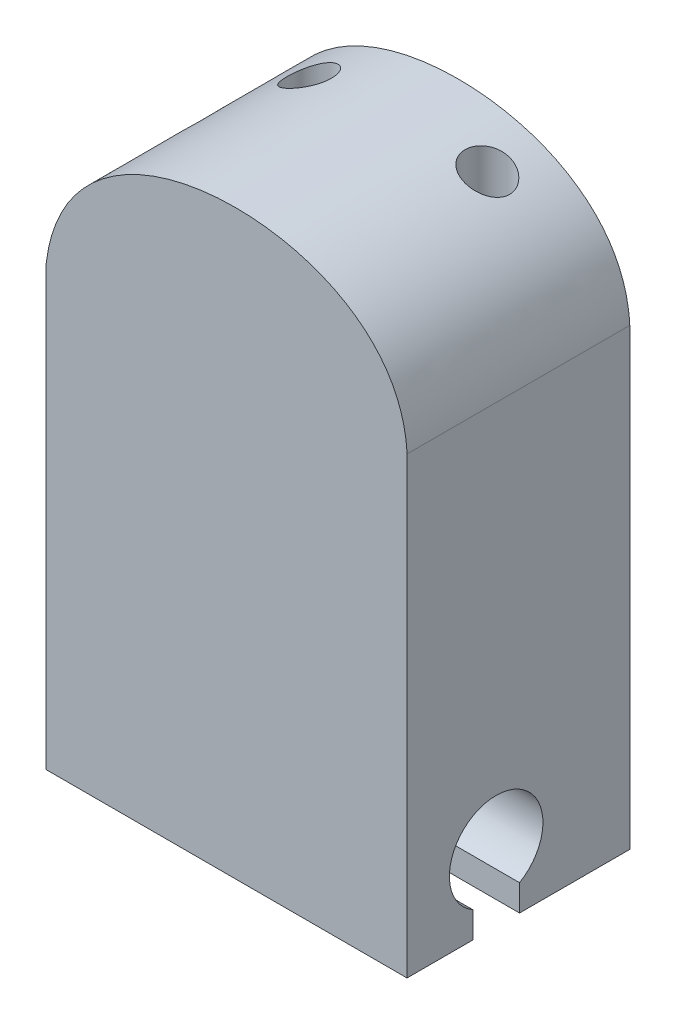
ISO-10303-21;
HEADER;
FILE_DESCRIPTION(('STEP AP214'),'2;1');
FILE_NAME('part.step','',(''),(''),'','','');
FILE_SCHEMA(('AUTOMOTIVE_DESIGN { 1 0 10303 214 1 1 1 1 }'));
ENDSEC;
DATA;
#1=APPLICATION_CONTEXT('core data for automotive mechanical design processes');
#2=APPLICATION_PROTOCOL_DEFINITION('international standard','automotive_design',2000,#1);
#3=PRODUCT_CONTEXT('',#1,'mechanical');
#4=PRODUCT('Part','Part','',(#3));
#5=PRODUCT_RELATED_PRODUCT_CATEGORY('part','',(#4));
#6=PRODUCT_DEFINITION_FORMATION('','',#4);
#7=PRODUCT_DEFINITION_CONTEXT('part definition',#1,'design');
#8=PRODUCT_DEFINITION('design','',#6,#7);
#9=PRODUCT_DEFINITION_SHAPE('','',#8);
#10=(LENGTH_UNIT() NAMED_UNIT(*) SI_UNIT(.MILLI.,.METRE.));
#11=(NAMED_UNIT(*) PLANE_ANGLE_UNIT() SI_UNIT($,.RADIAN.));
#12=(NAMED_UNIT(*) SI_UNIT($,.STERADIAN.) SOLID_ANGLE_UNIT());
#13=UNCERTAINTY_MEASURE_WITH_UNIT(LENGTH_MEASURE(1.E-05),#10,'distance_accuracy_value','');
#14=(GEOMETRIC_REPRESENTATION_CONTEXT(3) GLOBAL_UNCERTAINTY_ASSIGNED_CONTEXT((#13)) GLOBAL_UNIT_ASSIGNED_CONTEXT((#10,
#11,#12)) REPRESENTATION_CONTEXT('',''));
#15=CARTESIAN_POINT('',(0.,0.,0.));
#16=DIRECTION('',(0.,0.,1.));
#17=DIRECTION('',(1.,0.,0.));
#18=AXIS2_PLACEMENT_3D('',#15,#16,#17);
#19=CARTESIAN_POINT('',(8.10000000000001,0.,10.));
#20=DIRECTION('',(1.,0.,0.));
#21=DIRECTION('',(0.,1.,0.));
#22=AXIS2_PLACEMENT_3D('',#19,#20,#21);
#23=PLANE('',#22);
#24=DIRECTION('',(0.,1.,0.));
#25=VECTOR('',#24,1.);
#26=CARTESIAN_POINT('',(8.10000000000001,0.,4.95));
#27=LINE('',#26,#25);
#28=CARTESIAN_POINT('',(8.10000000000001,0.,4.95));
#29=VERTEX_POINT('',#28);
#30=CARTESIAN_POINT('',(8.10000000000001,1.18134665205268,4.95));
#31=VERTEX_POINT('',#30);
#32=EDGE_CURVE('E133',#29,#31,#27,.T.);
#33=ORIENTED_EDGE('',*,*,#32,.F.);
#34=DIRECTION('',(0.,0.,-1.));
#35=VECTOR('',#34,1.);
#36=CARTESIAN_POINT('',(8.10000000000001,0.,10.));
#37=LINE('',#36,#35);
#38=CARTESIAN_POINT('',(8.10000000000001,0.,0.));
#39=VERTEX_POINT('',#38);
#40=EDGE_CURVE('E78',#29,#39,#37,.T.);
#41=ORIENTED_EDGE('',*,*,#40,.T.);
#42=DIRECTION('',(0.,-1.,0.));
#43=VECTOR('',#42,1.);
#44=CARTESIAN_POINT('',(8.10000000000001,0.,0.));
#45=LINE('',#44,#43);
#46=CARTESIAN_POINT('',(8.1,20.3764508857299,0.));
#47=VERTEX_POINT('',#46);
#48=EDGE_CURVE('E152',#47,#39,#45,.T.);
#49=ORIENTED_EDGE('',*,*,#48,.F.);
#50=DIRECTION('',(0.,0.,-1.));
#51=VECTOR('',#50,1.);
#52=CARTESIAN_POINT('',(8.1,20.3764508857299,10.));
#53=LINE('',#52,#51);
#54=CARTESIAN_POINT('',(8.1,20.3764508857299,10.));
#55=VERTEX_POINT('',#54);
#56=EDGE_CURVE('E82',#55,#47,#53,.T.);
#57=ORIENTED_EDGE('',*,*,#56,.F.);
#58=DIRECTION('',(0.,-1.,0.));
#59=VECTOR('',#58,1.);
#60=CARTESIAN_POINT('',(8.10000000000001,0.,10.));
#61=LINE('',#60,#59);
#62=CARTESIAN_POINT('',(8.10000000000001,0.,10.));
#63=VERTEX_POINT('',#62);
#64=EDGE_CURVE('E165',#55,#63,#61,.T.);
#65=ORIENTED_EDGE('',*,*,#64,.T.);
#66=CARTESIAN_POINT('',(8.10000000000001,0.,7.05));
#67=VERTEX_POINT('',#66);
#68=EDGE_CURVE('E55',#63,#67,#37,.T.);
#69=ORIENTED_EDGE('',*,*,#68,.T.);
#70=DIRECTION('',(0.,1.,0.));
#71=VECTOR('',#70,1.);
#72=CARTESIAN_POINT('',(8.10000000000001,0.,7.05));
#73=LINE('',#72,#71);
#74=CARTESIAN_POINT('',(8.10000000000001,1.18134665205268,7.05));
#75=VERTEX_POINT('',#74);
#76=EDGE_CURVE('E47',#67,#75,#73,.T.);
#77=ORIENTED_EDGE('',*,*,#76,.T.);
#78=CARTESIAN_POINT('',(8.10000000000001,3.,6.));
#79=DIRECTION('',(1.,0.,0.));
#80=DIRECTION('',(0.,1.,0.));
#81=AXIS2_PLACEMENT_3D('',#78,#79,#80);
#82=CIRCLE('',#81,2.1);
#83=EDGE_CURVE('E139',#75,#31,#82,.F.);
#84=ORIENTED_EDGE('',*,*,#83,.T.);
#85=EDGE_LOOP('',(#33,#41,#49,#57,#65,#69,#77,#84));
#86=FACE_BOUND('',#85,.T.);
#87=ADVANCED_FACE('F33',(#86),#23,.T.);
#88=CARTESIAN_POINT('',(-8.1,0.,10.));
#89=DIRECTION('',(-1.,0.,0.));
#90=DIRECTION('',(0.,0.,1.));
#91=AXIS2_PLACEMENT_3D('',#88,#89,#90);
#92=PLANE('',#91);
#93=DIRECTION('',(0.,-1.,0.));
#94=VECTOR('',#93,1.);
#95=CARTESIAN_POINT('',(-8.1,0.,4.95));
#96=LINE('',#95,#94);
#97=CARTESIAN_POINT('',(-8.1,1.18134665205268,4.95));
#98=VERTEX_POINT('',#97);
#99=CARTESIAN_POINT('',(-8.1,0.,4.95));
#100=VERTEX_POINT('',#99);
#101=EDGE_CURVE('E135',#98,#100,#96,.T.);
#102=ORIENTED_EDGE('',*,*,#101,.F.);
#103=CARTESIAN_POINT('',(-8.1,3.,6.));
#104=DIRECTION('',(-1.,0.,0.));
#105=DIRECTION('',(0.,0.,1.));
#106=AXIS2_PLACEMENT_3D('',#103,#104,#105);
#107=CIRCLE('',#106,2.1);
#108=CARTESIAN_POINT('',(-8.1,1.18134665205268,7.05));
#109=VERTEX_POINT('',#108);
#110=EDGE_CURVE('E11',#98,#109,#107,.F.);
#111=ORIENTED_EDGE('',*,*,#110,.T.);
#112=DIRECTION('',(0.,-1.,0.));
#113=VECTOR('',#112,1.);
#114=CARTESIAN_POINT('',(-8.1,0.,7.05));
#115=LINE('',#114,#113);
#116=CARTESIAN_POINT('',(-8.1,0.,7.05));
#117=VERTEX_POINT('',#116);
#118=EDGE_CURVE('E107',#109,#117,#115,.T.);
#119=ORIENTED_EDGE('',*,*,#118,.T.);
#120=DIRECTION('',(0.,0.,-1.));
#121=VECTOR('',#120,1.);
#122=CARTESIAN_POINT('',(-8.1,0.,10.));
#123=LINE('',#122,#121);
#124=CARTESIAN_POINT('',(-8.1,0.,10.));
#125=VERTEX_POINT('',#124);
#126=EDGE_CURVE('E115',#125,#117,#123,.T.);
#127=ORIENTED_EDGE('',*,*,#126,.F.);
#128=DIRECTION('',(0.,1.,0.));
#129=VECTOR('',#128,1.);
#130=CARTESIAN_POINT('',(-8.1,0.,10.));
#131=LINE('',#130,#129);
#132=CARTESIAN_POINT('',(-8.1,19.7,10.));
#133=VERTEX_POINT('',#132);
#134=EDGE_CURVE('E146',#125,#133,#131,.T.);
#135=ORIENTED_EDGE('',*,*,#134,.T.);
#136=DIRECTION('',(0.,0.,-1.));
#137=VECTOR('',#136,1.);
#138=CARTESIAN_POINT('',(-8.1,19.7,10.));
#139=LINE('',#138,#137);
#140=CARTESIAN_POINT('',(-8.1,19.7,0.));
#141=VERTEX_POINT('',#140);
#142=EDGE_CURVE('E122',#133,#141,#139,.T.);
#143=ORIENTED_EDGE('',*,*,#142,.T.);
#144=DIRECTION('',(0.,1.,0.));
#145=VECTOR('',#144,1.);
#146=CARTESIAN_POINT('',(-8.1,0.,0.));
#147=LINE('',#146,#145);
#148=CARTESIAN_POINT('',(-8.1,0.,0.));
#149=VERTEX_POINT('',#148);
#150=EDGE_CURVE('E160',#149,#141,#147,.T.);
#151=ORIENTED_EDGE('',*,*,#150,.F.);
#152=EDGE_CURVE('E123',#100,#149,#123,.T.);
#153=ORIENTED_EDGE('',*,*,#152,.F.);
#154=EDGE_LOOP('',(#102,#111,#119,#127,#135,#143,#151,#153));
#155=FACE_BOUND('',#154,.T.);
#156=ADVANCED_FACE('F113',(#155),#92,.T.);
#157=CARTESIAN_POINT('',(0.,0.,10.));
#158=DIRECTION('',(0.,-1.,0.));
#159=DIRECTION('',(1.,0.,0.));
#160=AXIS2_PLACEMENT_3D('',#157,#158,#159);
#161=PLANE('',#160);
#162=ORIENTED_EDGE('',*,*,#126,.T.);
#163=DIRECTION('',(1.,0.,0.));
#164=VECTOR('',#163,1.);
#165=CARTESIAN_POINT('',(0.,0.,7.05));
#166=LINE('',#165,#164);
#167=EDGE_CURVE('E104',#117,#67,#166,.T.);
#168=ORIENTED_EDGE('',*,*,#167,.T.);
#169=ORIENTED_EDGE('',*,*,#68,.F.);
#170=DIRECTION('',(-1.,0.,0.));
#171=VECTOR('',#170,1.);
#172=CARTESIAN_POINT('',(0.,0.,10.));
#173=LINE('',#172,#171);
#174=EDGE_CURVE('E121',#63,#125,#173,.T.);
#175=ORIENTED_EDGE('',*,*,#174,.T.);
#176=EDGE_LOOP('',(#162,#168,#169,#175));
#177=FACE_BOUND('',#176,.T.);
#178=ADVANCED_FACE('F119',(#177),#161,.T.);
#179=CARTESIAN_POINT('',(-8.1,19.7,10.));
#180=CARTESIAN_POINT('',(-7.59664870889171,23.8813203225703,10.));
#181=CARTESIAN_POINT('',(-0.122394981939604,28.1142137971152,10.));
#182=CARTESIAN_POINT('',(8.323445378134,24.3049281468635,10.));
#183=CARTESIAN_POINT('',(8.10000000000001,19.7,10.));
#184=B_SPLINE_CURVE_WITH_KNOTS('',3,(#179,#180,#181,#182,#183),.UNSPECIFIED.,.F.,.F.,(4,1,4),
(0.,0.492427344246264,1.),.UNSPECIFIED.);
#185=DIRECTION('',(0.,0.,-1.));
#186=VECTOR('',#185,1.);
#187=SURFACE_OF_LINEAR_EXTRUSION('',#184,#186);
#188=CARTESIAN_POINT('',(-8.1,19.7,0.));
#189=CARTESIAN_POINT('',(-7.59664870889171,23.8813203225703,0.));
#190=CARTESIAN_POINT('',(-0.122394981939604,28.1142137971152,0.));
#191=CARTESIAN_POINT('',(8.323445378134,24.3049281468635,0.));
#192=CARTESIAN_POINT('',(8.10000000000001,19.7,0.));
#193=B_SPLINE_CURVE_WITH_KNOTS('',3,(#188,#189,#190,#191,#192),.UNSPECIFIED.,.F.,.F.,(4,1,4),
(0.,0.492427344246264,1.),.UNSPECIFIED.);
#194=EDGE_CURVE('E154',#141,#47,#193,.T.);
#195=ORIENTED_EDGE('',*,*,#194,.F.);
#196=ORIENTED_EDGE('',*,*,#142,.F.);
#197=EDGE_CURVE('E148',#133,#55,#184,.T.);
#198=ORIENTED_EDGE('',*,*,#197,.T.);
#199=ORIENTED_EDGE('',*,*,#56,.T.);
#200=EDGE_LOOP('',(#195,#196,#198,#199));
#201=FACE_BOUND('',#200,.T.);
#202=CARTESIAN_POINT('',(5.,25.0646013898831,2.2959207547828));
#203=CARTESIAN_POINT('',(4.99999703130871,25.0646035396713,2.34775146292357));
#204=CARTESIAN_POINT('',(4.99594851652372,25.066739716358,2.39962070958729));
#205=CARTESIAN_POINT('',(4.9799440846134,25.0751291906439,2.50181479879735));
#206=CARTESIAN_POINT('',(4.96797831416499,25.0813876184962,2.55213763500794));
#207=CARTESIAN_POINT('',(4.93675970413243,25.0975400825184,2.64959987024861));
#208=CARTESIAN_POINT('',(4.91753725333163,25.1074189524004,2.69675159189956));
#209=CARTESIAN_POINT('',(4.87253053069144,25.1302206982126,2.7870861864614));
#210=CARTESIAN_POINT('',(4.84673536119611,25.1431486268492,2.83026230432333));
#211=CARTESIAN_POINT('',(4.7878956510771,25.1721291876345,2.91396309869168));
#212=CARTESIAN_POINT('',(4.75453563991835,25.1883125550315,2.95421996617463));
#213=CARTESIAN_POINT('',(4.68245892344317,25.2225425478516,3.02868107723876));
#214=CARTESIAN_POINT('',(4.64374038042523,25.2405898119544,3.06288323515454));
#215=CARTESIAN_POINT('',(4.55756768686568,25.2798169878329,3.1279854121012));
#216=CARTESIAN_POINT('',(4.50962303616036,25.3011267086212,3.1581592811147));
#217=CARTESIAN_POINT('',(4.40962257064718,25.3443214106237,3.20991068059419));
#218=CARTESIAN_POINT('',(4.35757064983443,25.3662058341477,3.23149623881003));
#219=CARTESIAN_POINT('',(4.24709037535709,25.4112682158901,3.26675493618382));
#220=CARTESIAN_POINT('',(4.18846720303943,25.4344389747905,3.27983081651481));
#221=CARTESIAN_POINT('',(4.06948905801973,25.4799095605177,3.29530556960407));
#222=CARTESIAN_POINT('',(4.00913399582146,25.5022093421952,3.29770388959067));
#223=CARTESIAN_POINT('',(3.88851810555632,25.5452764863121,3.291517132741));
#224=CARTESIAN_POINT('',(3.828257263514,25.5660459436493,3.28294737732281));
#225=CARTESIAN_POINT('',(3.70967095711886,25.6055596165315,3.25478458960718));
#226=CARTESIAN_POINT('',(3.6513450115209,25.6243043383232,3.23519432041939));
#227=CARTESIAN_POINT('',(3.5412129307173,25.6585730616663,3.18641354769525));
#228=CARTESIAN_POINT('',(3.48923157038287,25.6742039697049,3.15769422250952));
#229=CARTESIAN_POINT('',(3.39072774908468,25.7029928943531,3.09110500403034));
#230=CARTESIAN_POINT('',(3.34420361642557,25.7161516689907,3.05323792387164));
#231=CARTESIAN_POINT('',(3.26054729091445,25.7392336701333,2.97153386150098));
#232=CARTESIAN_POINT('',(3.22305690880195,25.74928776904,2.92810028037699));
#233=CARTESIAN_POINT('',(3.15587937221169,25.7669606651713,2.83513032760758));
#234=CARTESIAN_POINT('',(3.12619053635523,25.7745799872123,2.7855952743288));
#235=CARTESIAN_POINT('',(3.07659459387819,25.7871337727255,2.68375569765745));
#236=CARTESIAN_POINT('',(3.05637597409671,25.7921544150089,2.63161329445614));
#237=CARTESIAN_POINT('',(3.02488470693274,25.7999150693298,2.52453258873803));
#238=CARTESIAN_POINT('',(3.01361100885825,25.8026553492259,2.46959461540256));
#239=CARTESIAN_POINT('',(3.00051687012333,25.8058338023592,2.35955031781661));
#240=CARTESIAN_POINT('',(2.99852917915429,25.8063127069497,2.30446500074268));
#241=CARTESIAN_POINT('',(3.00361731258456,25.8050809176439,2.19474088085373));
#242=CARTESIAN_POINT('',(3.01069269671909,25.8033703301086,2.14010205647881));
#243=CARTESIAN_POINT('',(3.03361706895522,25.797767411626,2.03307996268509));
#244=CARTESIAN_POINT('',(3.04942553095853,25.7938851573212,1.98068747034019));
#245=CARTESIAN_POINT('',(3.08926635663632,25.7839405037408,1.87935344432583));
#246=CARTESIAN_POINT('',(3.11329873870351,25.7778780995893,1.83041191837472));
#247=CARTESIAN_POINT('',(3.16899649257609,25.7635297689175,1.7369831720009));
#248=CARTESIAN_POINT('',(3.20071324179601,25.7552288315227,1.69252891382045));
#249=CARTESIAN_POINT('',(3.2706645072877,25.7364576963231,1.60961727742388));
#250=CARTESIAN_POINT('',(3.30889944140399,25.725987359441,1.57116028396177));
#251=CARTESIAN_POINT('',(3.39151892701842,25.7027237168621,1.50045467807647));
#252=CARTESIAN_POINT('',(3.43601207969879,25.6898877676421,1.46834713372677));
#253=CARTESIAN_POINT('',(3.52915968746354,25.662186926722,1.4120240930242));
#254=CARTESIAN_POINT('',(3.5778147442859,25.6473217414444,1.38780974033074));
#255=CARTESIAN_POINT('',(3.67969464704692,25.6152042167563,1.34696109329439));
#256=CARTESIAN_POINT('',(3.73302124439254,25.5978848361215,1.33063368531886));
#257=CARTESIAN_POINT('',(3.8411059068547,25.561616494873,1.30707571056444));
#258=CARTESIAN_POINT('',(3.89586430790198,25.5426671494042,1.29984729850567));
#259=CARTESIAN_POINT('',(4.0080908782814,25.5025669479266,1.29429987031062));
#260=CARTESIAN_POINT('',(4.06555932401507,25.4813535859019,1.29643846118977));
#261=CARTESIAN_POINT('',(4.17899326150859,25.4381110811692,1.31041084834838));
#262=CARTESIAN_POINT('',(4.23495833754466,25.4160817167397,1.32224729842578));
#263=CARTESIAN_POINT('',(4.34649169474909,25.3708332280898,1.35597916506281));
#264=CARTESIAN_POINT('',(4.40192590849891,25.3476055985986,1.3783080080723));
#265=CARTESIAN_POINT('',(4.50815405298532,25.3017982559896,1.43259148563656));
#266=CARTESIAN_POINT('',(4.55894841208511,25.2792184831923,1.46454523042297));
#267=CARTESIAN_POINT('',(4.65477407020226,25.2355342741584,1.53768063429313));
#268=CARTESIAN_POINT('',(4.69976419125266,25.2144408150194,1.57892307542333));
#269=CARTESIAN_POINT('',(4.78202626969384,25.1750528703028,1.66967719343916));
#270=CARTESIAN_POINT('',(4.81929896685975,25.1567581164915,1.71918807690753));
#271=CARTESIAN_POINT('',(4.88240730339251,25.1252879477449,1.82183883830876));
#272=CARTESIAN_POINT('',(4.90882202235039,25.111859923413,1.87454399751079));
#273=CARTESIAN_POINT('',(4.95212283740133,25.0896362578103,1.98457361593132));
#274=CARTESIAN_POINT('',(4.96903199698812,25.0808294076,2.04188650535994));
#275=CARTESIAN_POINT('',(4.98710339957998,25.0713798283545,2.13251561950341));
#276=CARTESIAN_POINT('',(4.9919289468192,25.0688460569706,2.16495006795201));
#277=CARTESIAN_POINT('',(4.99837812086959,25.0654561915086,2.23022477852616));
#278=CARTESIAN_POINT('',(5.00000188186746,25.0646000271221,2.26306502358674));
#279=CARTESIAN_POINT('',(5.,25.0646013898831,2.2959207547828));
#280=B_SPLINE_CURVE_WITH_KNOTS('',3,(#202,#203,#204,#205,#206,#207,#208,#209,#210,#211,#212,
#213,#214,#215,#216,#217,#218,#219,#220,#221,#222,#223,#224,#225,#226,#227,#228,#229,#230,#231,
#232,#233,#234,#235,#236,#237,#238,#239,#240,#241,#242,#243,#244,#245,#246,#247,#248,#249,#250,
#251,#252,#253,#254,#255,#256,#257,#258,#259,#260,#261,#262,#263,#264,#265,#266,#267,#268,#269,
#270,#271,#272,#273,#274,#275,#276,#277,#278,#279),.UNSPECIFIED.,.T.,.F.,(4,2,2,2,2,2,2,2,2,2,2,
2,2,2,2,2,2,2,2,2,2,2,2,2,2,2,2,2,2,2,2,2,2,2,2,2,2,2,4),(0.,0.155362485300356,
0.310918689674802,0.465830570641133,0.621000988138774,0.784523630632575,0.948102492614041,
1.12889372035191,1.30951555787992,1.50173861912081,1.69397163153241,1.88593640451995,
2.07785306872807,2.26114197029009,2.44437457809785,2.61825405367672,2.79209602419408,
2.95972857908391,3.12734144053458,3.29192347912178,3.45649752296892,3.62031419469238,
3.78413123279256,3.94907533219349,4.11403000922002,4.2823160648387,4.45062649291414,
4.62504340339206,4.79950160952171,4.98257520358313,5.16569891207167,5.3571598034223,
5.5486030007131,5.74133734093281,5.9340531975044,6.11444168895325,6.2943905906128,
6.39287973311033,6.49136474784553),.UNSPECIFIED.);
#281=CARTESIAN_POINT('',(5.,25.0646013898831,2.2959207547828));
#282=VERTEX_POINT('',#281);
#283=EDGE_CURVE('E155',#282,#282,#280,.T.);
#284=ORIENTED_EDGE('',*,*,#283,.T.);
#285=EDGE_LOOP('',(#284));
#286=FACE_BOUND('',#285,.T.);
#287=CARTESIAN_POINT('',(-3.,25.5826047567316,2.2959207547828));
#288=CARTESIAN_POINT('',(-3.00000267611521,25.5826043163217,2.24201131542848));
#289=CARTESIAN_POINT('',(-3.0043775901385,25.581174283254,2.18806099419514));
#290=CARTESIAN_POINT('',(-3.02173101522064,25.5754618813139,2.08167373902432));
#291=CARTESIAN_POINT('',(-3.03472015271976,25.5711759894447,2.0292387578765));
#292=CARTESIAN_POINT('',(-3.06880357661237,25.5597971202889,1.92748247595999));
#293=CARTESIAN_POINT('',(-3.08988590471048,25.5527082841008,1.87815670569743));
#294=CARTESIAN_POINT('',(-3.13940380242532,25.5357956345723,1.78385414216554));
#295=CARTESIAN_POINT('',(-3.16784115466437,25.5259711581558,1.73887840684127));
#296=CARTESIAN_POINT('',(-3.23158745808005,25.5035269342351,1.65372504094238));
#297=CARTESIAN_POINT('',(-3.26699823709207,25.4908653260593,1.61363481877275));
#298=CARTESIAN_POINT('',(-3.34320390961189,25.4630132405072,1.53999185022561));
#299=CARTESIAN_POINT('',(-3.38399984139649,25.4478222753137,1.50644036763765));
#300=CARTESIAN_POINT('',(-3.47168798347012,25.4143836008296,1.44510987956844));
#301=CARTESIAN_POINT('',(-3.51877461440483,25.3960272013563,1.41766860131644));
#302=CARTESIAN_POINT('',(-3.61600550014122,25.3571159908448,1.3710105330715));
#303=CARTESIAN_POINT('',(-3.66615060443973,25.3365605678173,1.35179604007797));
#304=CARTESIAN_POINT('',(-3.77158853151816,25.2921674576844,1.32070297595735));
#305=CARTESIAN_POINT('',(-3.82699988876437,25.2682017315171,1.30940993664773));
#306=CARTESIAN_POINT('',(-3.93823470898635,25.2187013421272,1.29625806381138));
#307=CARTESIAN_POINT('',(-3.99405831069432,25.1931661273751,1.29440256610916));
#308=CARTESIAN_POINT('',(-4.10899053017464,25.1391104441334,1.30009108769328));
#309=CARTESIAN_POINT('',(-4.16802651488739,25.1105105631573,1.30835992160683));
#310=CARTESIAN_POINT('',(-4.28354191952734,25.0529333337089,1.33512690951803));
#311=CARTESIAN_POINT('',(-4.34002033267112,25.0239558422728,1.35362905461435));
#312=CARTESIAN_POINT('',(-4.45182255679048,24.9650521060086,1.40164141493986));
#313=CARTESIAN_POINT('',(-4.50694630604498,24.9351511929546,1.43165730447103));
#314=CARTESIAN_POINT('',(-4.58511250664488,24.891686678009,1.48435875069161));
#315=CARTESIAN_POINT('',(-4.6104178381217,24.8774277836659,1.50320862129311));
#316=CARTESIAN_POINT('',(-4.65938480435714,24.8495104571032,1.54344641016409));
#317=CARTESIAN_POINT('',(-4.68304304847754,24.8358532836058,1.56483933198509));
#318=CARTESIAN_POINT('',(-4.74979625952738,24.7968947702542,1.63133827438437));
#319=CARTESIAN_POINT('',(-4.79026139872554,24.772713107849,1.67983450948827));
#320=CARTESIAN_POINT('',(-4.86200500657713,24.7291429383926,1.78505722727423));
#321=CARTESIAN_POINT('',(-4.89330109740442,24.7097452484404,1.84176760519843));
#322=CARTESIAN_POINT('',(-4.93018555655782,24.6866411794232,1.92773305028598));
#323=CARTESIAN_POINT('',(-4.9403078343674,24.6802617333941,1.95439525632617));
#324=CARTESIAN_POINT('',(-4.95829983737998,24.6688766965847,2.00872619826285));
#325=CARTESIAN_POINT('',(-4.96617144748455,24.6638699563285,2.03639406990859));
#326=CARTESIAN_POINT('',(-4.98617973271537,24.6511108456164,2.12054933680206));
#327=CARTESIAN_POINT('',(-4.99475943518918,24.645588196884,2.17830272563884));
#328=CARTESIAN_POINT('',(-5.00118267020164,24.6414555896216,2.28591874327666));
#329=CARTESIAN_POINT('',(-5.00043641688085,24.6419376028501,2.335673768723));
#330=CARTESIAN_POINT('',(-4.99161871874442,24.6476052621453,2.43425855411897));
#331=CARTESIAN_POINT('',(-4.98354832922802,24.652790230586,2.48308844633184));
#332=CARTESIAN_POINT('',(-4.96096686395001,24.6671875604073,2.57658189996034));
#333=CARTESIAN_POINT('',(-4.94671161484802,24.6762397529535,2.62133323427154));
#334=CARTESIAN_POINT('',(-4.91246939395445,24.6977645505201,2.70769615986001));
#335=CARTESIAN_POINT('',(-4.89248106007103,24.7102379683398,2.74930700203411));
#336=CARTESIAN_POINT('',(-4.84550972145417,24.7391832092558,2.83218300772687));
#337=CARTESIAN_POINT('',(-4.81806668671768,24.7559099288511,2.87309708277848));
#338=CARTESIAN_POINT('',(-4.75810895584082,24.7918675765497,2.94987007430695));
#339=CARTESIAN_POINT('',(-4.72558526290227,24.8111029367644,2.98571980420639));
#340=CARTESIAN_POINT('',(-4.65131437153941,24.8542356169752,3.05670602831154));
#341=CARTESIAN_POINT('',(-4.60891343854353,24.8784051682082,3.09099360155184));
#342=CARTESIAN_POINT('',(-4.51968660729593,24.9281085585494,3.15198749634787));
#343=CARTESIAN_POINT('',(-4.47285819468226,24.9536431692535,3.17868947516354));
#344=CARTESIAN_POINT('',(-4.36984331688361,25.0084473183994,3.22695925086872));
#345=CARTESIAN_POINT('',(-4.31321273314797,25.0377917756702,3.24750005358066));
#346=CARTESIAN_POINT('',(-4.19715354140204,25.0962024432467,3.27812693242189));
#347=CARTESIAN_POINT('',(-4.13772836593888,25.125268944723,3.28822550112931));
#348=CARTESIAN_POINT('',(-4.01509645915595,25.1834837626093,3.29777001660735));
#349=CARTESIAN_POINT('',(-3.95183354061044,25.2125888573809,3.29677376294447));
#350=CARTESIAN_POINT('',(-3.82575878713176,25.2688091910079,3.2826629842007));
#351=CARTESIAN_POINT('',(-3.76294686588396,25.2959248203006,3.2695508437945));
#352=CARTESIAN_POINT('',(-3.64266890703984,25.3462992613311,3.23192814408252));
#353=CARTESIAN_POINT('',(-3.585089197264,25.3696747447264,3.20793998730318));
#354=CARTESIAN_POINT('',(-3.47453280671842,25.4133541678079,3.14903302757871));
#355=CARTESIAN_POINT('',(-3.42155357005395,25.4336598177154,3.11412034427777));
#356=CARTESIAN_POINT('',(-3.32640566187385,25.4692591980107,3.0373426645388));
#357=CARTESIAN_POINT('',(-3.28371191339557,25.48482339792,2.99625355607035));
#358=CARTESIAN_POINT('',(-3.20583420089338,25.5126877868491,2.90651474811885));
#359=CARTESIAN_POINT('',(-3.1706489035771,25.5249885554584,2.85786639360375));
#360=CARTESIAN_POINT('',(-3.11144814976311,25.5453936656594,2.75809727534006));
#361=CARTESIAN_POINT('',(-3.08682730462309,25.553729862405,2.70738191601987));
#362=CARTESIAN_POINT('',(-3.04640418627198,25.5672985918085,2.60221676788468));
#363=CARTESIAN_POINT('',(-3.03058778594485,25.5725360973052,2.54777311985406));
#364=CARTESIAN_POINT('',(-3.01301174273659,25.5783343698643,2.4600603647035));
#365=CARTESIAN_POINT('',(-3.00814000201492,25.5799348520697,2.42744936169601));
#366=CARTESIAN_POINT('',(-3.00163334394803,25.5820701697103,2.36187092032978));
#367=CARTESIAN_POINT('',(-2.99999836270609,25.582605026182,2.32890348902018));
#368=CARTESIAN_POINT('',(-3.,25.5826047567316,2.2959207547828));
#369=B_SPLINE_CURVE_WITH_KNOTS('',3,(#287,#288,#289,#290,#291,#292,#293,#294,#295,#296,#297,
#298,#299,#300,#301,#302,#303,#304,#305,#306,#307,#308,#309,#310,#311,#312,#313,#314,#315,#316,
#317,#318,#319,#320,#321,#322,#323,#324,#325,#326,#327,#328,#329,#330,#331,#332,#333,#334,#335,
#336,#337,#338,#339,#340,#341,#342,#343,#344,#345,#346,#347,#348,#349,#350,#351,#352,#353,#354,
#355,#356,#357,#358,#359,#360,#361,#362,#363,#364,#365,#366,#367,#368),.UNSPECIFIED.,.T.,.F.,(4,
2,2,2,2,2,2,2,2,2,2,2,2,2,2,2,2,2,2,2,2,2,2,2,2,2,2,2,2,2,2,2,2,2,2,2,2,2,2,2,4),(0.,
0.161605225641096,0.323410177998423,0.48497696595258,0.646582949277288,0.8107519330154,
0.974952615482042,1.14672872864902,1.31855277216993,1.50202355382772,1.68555918116706,
1.8830384731753,2.08059483854396,2.28806195607282,2.39182405233802,2.49579379311885,
2.69747815847054,2.89877232092743,2.98632571254069,3.07380556323402,3.248386326575,
3.39693314986347,3.54545857315874,3.68835209749151,3.83127959926583,3.98675551105294,
4.14250992649992,4.32073294894459,4.4990577990907,4.6991871078994,4.89907671380371,
5.10696081987525,5.31480401846685,5.51357687168183,5.7122385760942,5.89506662356546,
6.0778621787889,6.24798141031439,6.41782688545915,6.51670172998633,6.6155746226102),.UNSPECIFIED.);
#370=CARTESIAN_POINT('',(-3.,25.5826047567316,2.2959207547828));
#371=VERTEX_POINT('',#370);
#372=EDGE_CURVE('E207',#371,#371,#369,.T.);
#373=ORIENTED_EDGE('',*,*,#372,.F.);
#374=EDGE_LOOP('',(#373));
#375=FACE_BOUND('',#374,.T.);
#376=ADVANCED_FACE('F180',(#201,#286,#375),#187,.T.);
#377=DIRECTION('',(1.,0.,0.));
#378=VECTOR('',#377,1.);
#379=CARTESIAN_POINT('',(0.,0.,4.95));
#380=LINE('',#379,#378);
#381=EDGE_CURVE('E40',#100,#29,#380,.T.);
#382=ORIENTED_EDGE('',*,*,#381,.F.);
#383=ORIENTED_EDGE('',*,*,#152,.T.);
#384=DIRECTION('',(-1.,0.,0.));
#385=VECTOR('',#384,1.);
#386=CARTESIAN_POINT('',(0.,0.,0.));
#387=LINE('',#386,#385);
#388=EDGE_CURVE('E145',#39,#149,#387,.T.);
#389=ORIENTED_EDGE('',*,*,#388,.F.);
#390=ORIENTED_EDGE('',*,*,#40,.F.);
#391=EDGE_LOOP('',(#382,#383,#389,#390));
#392=FACE_BOUND('',#391,.T.);
#393=CARTESIAN_POINT('',(-4.,0.,2.2959207547828));
#394=DIRECTION('',(0.,-1.,0.));
#395=DIRECTION('',(1.,0.,0.));
#396=AXIS2_PLACEMENT_3D('',#393,#394,#395);
#397=CIRCLE('',#396,1.);
#398=CARTESIAN_POINT('',(-3.,0.,2.2959207547828));
#399=VERTEX_POINT('',#398);
#400=EDGE_CURVE('E334',#399,#399,#397,.F.);
#401=ORIENTED_EDGE('',*,*,#400,.T.);
#402=EDGE_LOOP('',(#401));
#403=FACE_BOUND('',#402,.T.);
#404=CARTESIAN_POINT('',(4.,0.,2.2959207547828));
#405=DIRECTION('',(0.,-1.,0.));
#406=DIRECTION('',(1.,0.,0.));
#407=AXIS2_PLACEMENT_3D('',#404,#405,#406);
#408=CIRCLE('',#407,1.);
#409=CARTESIAN_POINT('',(5.,0.,2.2959207547828));
#410=VERTEX_POINT('',#409);
#411=EDGE_CURVE('E204',#410,#410,#408,.T.);
#412=ORIENTED_EDGE('',*,*,#411,.F.);
#413=EDGE_LOOP('',(#412));
#414=FACE_BOUND('',#413,.T.);
#415=ADVANCED_FACE('F142',(#392,#403,#414),#161,.T.);
#416=CARTESIAN_POINT('',(0.,0.,10.));
#417=DIRECTION('',(0.,0.,1.));
#418=DIRECTION('',(1.,0.,0.));
#419=AXIS2_PLACEMENT_3D('',#416,#417,#418);
#420=PLANE('',#419);
#421=ORIENTED_EDGE('',*,*,#64,.F.);
#422=ORIENTED_EDGE('',*,*,#197,.F.);
#423=ORIENTED_EDGE('',*,*,#134,.F.);
#424=ORIENTED_EDGE('',*,*,#174,.F.);
#425=EDGE_LOOP('',(#421,#422,#423,#424));
#426=FACE_BOUND('',#425,.T.);
#427=ADVANCED_FACE('F188',(#426),#420,.T.);
#428=CARTESIAN_POINT('',(0.,0.,0.));
#429=DIRECTION('',(0.,0.,1.));
#430=DIRECTION('',(1.,0.,0.));
#431=AXIS2_PLACEMENT_3D('',#428,#429,#430);
#432=PLANE('',#431);
#433=ORIENTED_EDGE('',*,*,#48,.T.);
#434=ORIENTED_EDGE('',*,*,#388,.T.);
#435=ORIENTED_EDGE('',*,*,#150,.T.);
#436=ORIENTED_EDGE('',*,*,#194,.T.);
#437=EDGE_LOOP('',(#433,#434,#435,#436));
#438=FACE_BOUND('',#437,.T.);
#439=ADVANCED_FACE('F189',(#438),#432,.F.);
#440=CARTESIAN_POINT('',(4.,28.0068522925139,2.2959207547828));
#441=DIRECTION('',(0.,-1.,0.));
#442=DIRECTION('',(1.,0.,0.));
#443=AXIS2_PLACEMENT_3D('',#440,#441,#442);
#444=CYLINDRICAL_SURFACE('',#443,1.);
#445=ORIENTED_EDGE('',*,*,#411,.T.);
#446=EDGE_LOOP('',(#445));
#447=FACE_BOUND('',#446,.T.);
#448=ORIENTED_EDGE('',*,*,#283,.F.);
#449=EDGE_LOOP('',(#448));
#450=FACE_BOUND('',#449,.T.);
#451=ADVANCED_FACE('F192',(#447,#450),#444,.F.);
#452=CARTESIAN_POINT('',(-4.,28.0068522925139,2.2959207547828));
#453=DIRECTION('',(0.,-1.,0.));
#454=DIRECTION('',(1.,0.,0.));
#455=AXIS2_PLACEMENT_3D('',#452,#453,#454);
#456=CYLINDRICAL_SURFACE('',#455,1.);
#457=ORIENTED_EDGE('',*,*,#400,.F.);
#458=EDGE_LOOP('',(#457));
#459=FACE_BOUND('',#458,.T.);
#460=ORIENTED_EDGE('',*,*,#372,.T.);
#461=EDGE_LOOP('',(#460));
#462=FACE_BOUND('',#461,.T.);
#463=ADVANCED_FACE('F220',(#459,#462),#456,.F.);
#464=CARTESIAN_POINT('',(-14.1,0.,4.95));
#465=DIRECTION('',(0.,0.,-1.));
#466=DIRECTION('',(-1.,0.,0.));
#467=AXIS2_PLACEMENT_3D('',#464,#465,#466);
#468=PLANE('',#467);
#469=ORIENTED_EDGE('',*,*,#32,.T.);
#470=DIRECTION('',(1.,0.,0.));
#471=VECTOR('',#470,1.);
#472=CARTESIAN_POINT('',(-14.1,1.18134665205268,4.95));
#473=LINE('',#472,#471);
#474=EDGE_CURVE('E342',#98,#31,#473,.T.);
#475=ORIENTED_EDGE('',*,*,#474,.F.);
#476=ORIENTED_EDGE('',*,*,#101,.T.);
#477=ORIENTED_EDGE('',*,*,#381,.T.);
#478=EDGE_LOOP('',(#469,#475,#476,#477));
#479=FACE_BOUND('',#478,.T.);
#480=ADVANCED_FACE('F131',(#479),#468,.F.);
#481=CARTESIAN_POINT('',(-14.1,0.,7.05));
#482=DIRECTION('',(0.,0.,-1.));
#483=DIRECTION('',(-1.,0.,0.));
#484=AXIS2_PLACEMENT_3D('',#481,#482,#483);
#485=PLANE('',#484);
#486=ORIENTED_EDGE('',*,*,#167,.F.);
#487=ORIENTED_EDGE('',*,*,#118,.F.);
#488=DIRECTION('',(1.,0.,0.));
#489=VECTOR('',#488,1.);
#490=CARTESIAN_POINT('',(-14.1,1.18134665205268,7.05));
#491=LINE('',#490,#489);
#492=EDGE_CURVE('E117',#109,#75,#491,.T.);
#493=ORIENTED_EDGE('',*,*,#492,.T.);
#494=ORIENTED_EDGE('',*,*,#76,.F.);
#495=EDGE_LOOP('',(#486,#487,#493,#494));
#496=FACE_BOUND('',#495,.T.);
#497=ADVANCED_FACE('F106',(#496),#485,.T.);
#498=CARTESIAN_POINT('',(-14.1,3.,6.));
#499=DIRECTION('',(1.,0.,0.));
#500=DIRECTION('',(0.,1.,0.));
#501=AXIS2_PLACEMENT_3D('',#498,#499,#500);
#502=CYLINDRICAL_SURFACE('',#501,2.1);
#503=ORIENTED_EDGE('',*,*,#492,.F.);
#504=ORIENTED_EDGE('',*,*,#110,.F.);
#505=ORIENTED_EDGE('',*,*,#474,.T.);
#506=ORIENTED_EDGE('',*,*,#83,.F.);
#507=EDGE_LOOP('',(#503,#504,#505,#506));
#508=FACE_BOUND('',#507,.T.);
#509=ADVANCED_FACE('F229',(#508),#502,.F.);
#510=CLOSED_SHELL('',(#87,#156,#178,#376,#415,#427,#439,#451,#463,#480,#497,#509));
#511=MANIFOLD_SOLID_BREP('B2',#510);
#512=ADVANCED_BREP_SHAPE_REPRESENTATION('',(#18,#511),#14);
#513=SHAPE_DEFINITION_REPRESENTATION(#9,#512);
ENDSEC;
END-ISO-10303-21;
